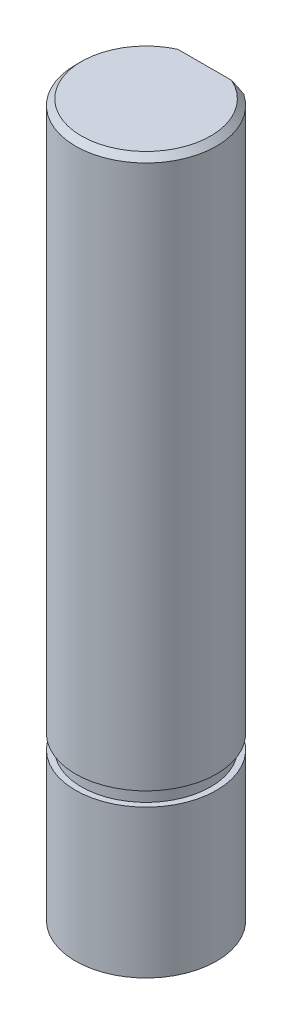
ISO-10303-21;
HEADER;
FILE_DESCRIPTION(('STEP AP214'),'2;1');
FILE_NAME('part.step','',(''),(''),'','','');
FILE_SCHEMA(('AUTOMOTIVE_DESIGN { 1 0 10303 214 1 1 1 1 }'));
ENDSEC;
DATA;
#1=APPLICATION_CONTEXT('core data for automotive mechanical design processes');
#2=APPLICATION_PROTOCOL_DEFINITION('international standard','automotive_design',2000,#1);
#3=PRODUCT_CONTEXT('',#1,'mechanical');
#4=PRODUCT('Part','Part','',(#3));
#5=PRODUCT_RELATED_PRODUCT_CATEGORY('part','',(#4));
#6=PRODUCT_DEFINITION_FORMATION('','',#4);
#7=PRODUCT_DEFINITION_CONTEXT('part definition',#1,'design');
#8=PRODUCT_DEFINITION('design','',#6,#7);
#9=PRODUCT_DEFINITION_SHAPE('','',#8);
#10=(LENGTH_UNIT() NAMED_UNIT(*) SI_UNIT(.MILLI.,.METRE.));
#11=(NAMED_UNIT(*) PLANE_ANGLE_UNIT() SI_UNIT($,.RADIAN.));
#12=(NAMED_UNIT(*) SI_UNIT($,.STERADIAN.) SOLID_ANGLE_UNIT());
#13=UNCERTAINTY_MEASURE_WITH_UNIT(LENGTH_MEASURE(1.E-05),#10,'distance_accuracy_value','');
#14=(GEOMETRIC_REPRESENTATION_CONTEXT(3) GLOBAL_UNCERTAINTY_ASSIGNED_CONTEXT((#13)) GLOBAL_UNIT_ASSIGNED_CONTEXT((#10,
#11,#12)) REPRESENTATION_CONTEXT('',''));
#15=CARTESIAN_POINT('',(0.,0.,0.));
#16=DIRECTION('',(0.,0.,1.));
#17=DIRECTION('',(1.,0.,0.));
#18=AXIS2_PLACEMENT_3D('',#15,#16,#17);
#19=CARTESIAN_POINT('',(0.,16.4,0.));
#20=DIRECTION('',(0.,1.,0.));
#21=DIRECTION('',(-1.,0.,0.));
#22=AXIS2_PLACEMENT_3D('',#19,#20,#21);
#23=CYLINDRICAL_SURFACE('',#22,3.);
#24=DIRECTION('',(0.,1.,0.));
#25=VECTOR('',#24,1.);
#26=CARTESIAN_POINT('',(1.6583123951777,16.4,-2.5));
#27=LINE('',#26,#25);
#28=CARTESIAN_POINT('',(1.6583123951777,20.4,-2.5));
#29=VERTEX_POINT('',#28);
#30=CARTESIAN_POINT('',(1.6583123951777,40.15,-2.5));
#31=VERTEX_POINT('',#30);
#32=EDGE_CURVE('E98',#29,#31,#27,.T.);
#33=ORIENTED_EDGE('',*,*,#32,.T.);
#34=CARTESIAN_POINT('',(0.,40.15,0.));
#35=DIRECTION('',(0.,1.,0.));
#36=DIRECTION('',(-1.,0.,0.));
#37=AXIS2_PLACEMENT_3D('',#34,#35,#36);
#38=CIRCLE('',#37,3.);
#39=CARTESIAN_POINT('',(3.,40.15,0.));
#40=VERTEX_POINT('',#39);
#41=EDGE_CURVE('E27',#40,#31,#38,.T.);
#42=ORIENTED_EDGE('',*,*,#41,.F.);
#43=DIRECTION('',(0.,-1.,0.));
#44=VECTOR('',#43,1.);
#45=CARTESIAN_POINT('',(3.,16.4,0.));
#46=LINE('',#45,#44);
#47=CARTESIAN_POINT('',(3.,17.,0.));
#48=VERTEX_POINT('',#47);
#49=EDGE_CURVE('E11',#40,#48,#46,.T.);
#50=ORIENTED_EDGE('',*,*,#49,.T.);
#51=CARTESIAN_POINT('',(0.,17.,0.));
#52=DIRECTION('',(0.,1.,0.));
#53=DIRECTION('',(-1.,0.,0.));
#54=AXIS2_PLACEMENT_3D('',#51,#52,#53);
#55=CIRCLE('',#54,3.);
#56=EDGE_CURVE('E94',#48,#48,#55,.T.);
#57=ORIENTED_EDGE('',*,*,#56,.T.);
#58=ORIENTED_EDGE('',*,*,#49,.F.);
#59=CARTESIAN_POINT('',(0.,40.15,0.));
#60=DIRECTION('',(0.,1.,0.));
#61=DIRECTION('',(-1.,0.,0.));
#62=AXIS2_PLACEMENT_3D('',#59,#60,#61);
#63=CIRCLE('',#62,3.);
#64=CARTESIAN_POINT('',(-1.6583123951777,40.15,-2.5));
#65=VERTEX_POINT('',#64);
#66=EDGE_CURVE('E148',#65,#40,#63,.T.);
#67=ORIENTED_EDGE('',*,*,#66,.F.);
#68=DIRECTION('',(0.,-1.,0.));
#69=VECTOR('',#68,1.);
#70=CARTESIAN_POINT('',(-1.6583123951777,16.4,-2.5));
#71=LINE('',#70,#69);
#72=CARTESIAN_POINT('',(-1.6583123951777,20.4,-2.5));
#73=VERTEX_POINT('',#72);
#74=EDGE_CURVE('E121',#65,#73,#71,.T.);
#75=ORIENTED_EDGE('',*,*,#74,.T.);
#76=CARTESIAN_POINT('',(0.,20.4,0.));
#77=DIRECTION('',(0.,-1.,0.));
#78=DIRECTION('',(-1.,0.,0.));
#79=AXIS2_PLACEMENT_3D('',#76,#77,#78);
#80=CIRCLE('',#79,3.);
#81=EDGE_CURVE('E140',#73,#29,#80,.T.);
#82=ORIENTED_EDGE('',*,*,#81,.T.);
#83=EDGE_LOOP('',(#33,#42,#50,#57,#58,#67,#75,#82));
#84=FACE_BOUND('',#83,.T.);
#85=ADVANCED_FACE('F16',(#84),#23,.T.);
#86=CARTESIAN_POINT('',(0.,40.275,0.));
#87=DIRECTION('',(0.,-1.,0.));
#88=DIRECTION('',(0.,0.,1.));
#89=AXIS2_PLACEMENT_3D('',#86,#87,#88);
#90=CONICAL_SURFACE('',#89,2.875,0.785398163397442);
#91=CARTESIAN_POINT('',(1.6583123951777,40.15,-2.5));
#92=CARTESIAN_POINT('',(1.39083319268792,40.2978546923137,-2.5));
#93=CARTESIAN_POINT('',(1.14564392373896,40.4,-2.5));
#94=(BOUNDED_CURVE() B_SPLINE_CURVE(2,(#91,#92,#93),.UNSPECIFIED.,.F.,
.F.) B_SPLINE_CURVE_WITH_KNOTS((3,3),(0.,0.057059215015008),
.UNSPECIFIED.) CURVE() GEOMETRIC_REPRESENTATION_ITEM() RATIONAL_B_SPLINE_CURVE((1.,
1.00399858489225,1.)) REPRESENTATION_ITEM(''));
#95=CARTESIAN_POINT('',(1.14564392373896,40.4,-2.5));
#96=VERTEX_POINT('',#95);
#97=EDGE_CURVE('E104',#31,#96,#94,.T.);
#98=ORIENTED_EDGE('',*,*,#97,.T.);
#99=CARTESIAN_POINT('',(0.,40.4,0.));
#100=DIRECTION('',(0.,-1.,0.));
#101=DIRECTION('',(-1.,0.,0.));
#102=AXIS2_PLACEMENT_3D('',#99,#100,#101);
#103=CIRCLE('',#102,2.75);
#104=CARTESIAN_POINT('',(-1.14564392373896,40.4,-2.5));
#105=VERTEX_POINT('',#104);
#106=EDGE_CURVE('E20',#96,#105,#103,.T.);
#107=ORIENTED_EDGE('',*,*,#106,.T.);
#108=CARTESIAN_POINT('',(-1.14564392373896,40.4,-2.5));
#109=CARTESIAN_POINT('',(-1.39083319268792,40.2978546923137,-2.5));
#110=CARTESIAN_POINT('',(-1.6583123951777,40.15,-2.5));
#111=(BOUNDED_CURVE() B_SPLINE_CURVE(2,(#108,#109,#110),.UNSPECIFIED.,.F.,
.F.) B_SPLINE_CURVE_WITH_KNOTS((3,3),(0.,0.057059215015008),
.UNSPECIFIED.) CURVE() GEOMETRIC_REPRESENTATION_ITEM() RATIONAL_B_SPLINE_CURVE((1.,
1.00399858489225,1.)) REPRESENTATION_ITEM(''));
#112=EDGE_CURVE('E122',#105,#65,#111,.T.);
#113=ORIENTED_EDGE('',*,*,#112,.T.);
#114=ORIENTED_EDGE('',*,*,#66,.T.);
#115=ORIENTED_EDGE('',*,*,#41,.T.);
#116=EDGE_LOOP('',(#98,#107,#113,#114,#115));
#117=FACE_BOUND('',#116,.T.);
#118=ADVANCED_FACE('F180',(#117),#90,.T.);
#119=CARTESIAN_POINT('',(0.,40.4,0.));
#120=DIRECTION('',(0.,1.,0.));
#121=DIRECTION('',(1.,0.,0.));
#122=AXIS2_PLACEMENT_3D('',#119,#120,#121);
#123=PLANE('',#122);
#124=DIRECTION('',(-1.,0.,0.));
#125=VECTOR('',#124,1.);
#126=CARTESIAN_POINT('',(0.82915619758885,40.4,-2.5));
#127=LINE('',#126,#125);
#128=EDGE_CURVE('E127',#96,#105,#127,.T.);
#129=ORIENTED_EDGE('',*,*,#128,.T.);
#130=ORIENTED_EDGE('',*,*,#106,.F.);
#131=EDGE_LOOP('',(#129,#130));
#132=FACE_BOUND('',#131,.T.);
#133=ADVANCED_FACE('F185',(#132),#123,.T.);
#134=CARTESIAN_POINT('',(0.,20.4,-2.75));
#135=DIRECTION('',(0.,1.,0.));
#136=DIRECTION('',(1.,0.,0.));
#137=AXIS2_PLACEMENT_3D('',#134,#135,#136);
#138=PLANE('',#137);
#139=ORIENTED_EDGE('',*,*,#81,.F.);
#140=DIRECTION('',(-1.,0.,0.));
#141=VECTOR('',#140,1.);
#142=CARTESIAN_POINT('',(0.82915619758885,20.4,-2.5));
#143=LINE('',#142,#141);
#144=EDGE_CURVE('E118',#29,#73,#143,.T.);
#145=ORIENTED_EDGE('',*,*,#144,.F.);
#146=EDGE_LOOP('',(#139,#145));
#147=FACE_BOUND('',#146,.T.);
#148=ADVANCED_FACE('F190',(#147),#138,.T.);
#149=CARTESIAN_POINT('',(1.6583123951777,40.4,-2.5));
#150=DIRECTION('',(0.,0.,1.));
#151=DIRECTION('',(1.,0.,0.));
#152=AXIS2_PLACEMENT_3D('',#149,#150,#151);
#153=PLANE('',#152);
#154=ORIENTED_EDGE('',*,*,#97,.F.);
#155=ORIENTED_EDGE('',*,*,#32,.F.);
#156=ORIENTED_EDGE('',*,*,#144,.T.);
#157=ORIENTED_EDGE('',*,*,#74,.F.);
#158=ORIENTED_EDGE('',*,*,#112,.F.);
#159=ORIENTED_EDGE('',*,*,#128,.F.);
#160=EDGE_LOOP('',(#154,#155,#156,#157,#158,#159));
#161=FACE_BOUND('',#160,.T.);
#162=ADVANCED_FACE('F188',(#161),#153,.F.);
#163=CARTESIAN_POINT('',(0.,10.1,0.));
#164=DIRECTION('',(0.,1.,0.));
#165=DIRECTION('',(1.,0.,0.));
#166=AXIS2_PLACEMENT_3D('',#163,#164,#165);
#167=PLANE('',#166);
#168=CARTESIAN_POINT('',(0.,10.1,0.));
#169=DIRECTION('',(0.,-1.,0.));
#170=DIRECTION('',(-1.,0.,0.));
#171=AXIS2_PLACEMENT_3D('',#168,#169,#170);
#172=CIRCLE('',#171,3.);
#173=CARTESIAN_POINT('',(3.,10.1,0.));
#174=VERTEX_POINT('',#173);
#175=EDGE_CURVE('E110',#174,#174,#172,.T.);
#176=ORIENTED_EDGE('',*,*,#175,.T.);
#177=EDGE_LOOP('',(#176));
#178=FACE_BOUND('',#177,.T.);
#179=ADVANCED_FACE('F18',(#178),#167,.F.);
#180=CARTESIAN_POINT('',(0.,16.4,0.));
#181=DIRECTION('',(0.,1.,0.));
#182=DIRECTION('',(-1.,0.,0.));
#183=AXIS2_PLACEMENT_3D('',#180,#181,#182);
#184=CYLINDRICAL_SURFACE('',#183,3.);
#185=CARTESIAN_POINT('',(0.,16.4,0.));
#186=DIRECTION('',(0.,-1.,0.));
#187=DIRECTION('',(-1.,0.,0.));
#188=AXIS2_PLACEMENT_3D('',#185,#186,#187);
#189=CIRCLE('',#188,3.);
#190=CARTESIAN_POINT('',(3.,16.4,0.));
#191=VERTEX_POINT('',#190);
#192=EDGE_CURVE('E103',#191,#191,#189,.T.);
#193=ORIENTED_EDGE('',*,*,#192,.T.);
#194=DIRECTION('',(0.,-1.,0.));
#195=VECTOR('',#194,1.);
#196=CARTESIAN_POINT('',(3.,16.4,0.));
#197=LINE('',#196,#195);
#198=EDGE_CURVE('E117',#191,#174,#197,.T.);
#199=ORIENTED_EDGE('',*,*,#198,.T.);
#200=ORIENTED_EDGE('',*,*,#175,.F.);
#201=ORIENTED_EDGE('',*,*,#198,.F.);
#202=EDGE_LOOP('',(#193,#199,#200,#201));
#203=FACE_BOUND('',#202,.T.);
#204=ADVANCED_FACE('F161',(#203),#184,.T.);
#205=CARTESIAN_POINT('',(0.,16.4,0.));
#206=DIRECTION('',(0.,1.,0.));
#207=DIRECTION('',(1.,0.,0.));
#208=AXIS2_PLACEMENT_3D('',#205,#206,#207);
#209=PLANE('',#208);
#210=CARTESIAN_POINT('',(0.,16.4,0.));
#211=DIRECTION('',(0.,1.,0.));
#212=DIRECTION('',(-1.,0.,0.));
#213=AXIS2_PLACEMENT_3D('',#210,#211,#212);
#214=CIRCLE('',#213,2.75);
#215=CARTESIAN_POINT('',(2.75,16.4,0.));
#216=VERTEX_POINT('',#215);
#217=EDGE_CURVE('E84',#216,#216,#214,.T.);
#218=ORIENTED_EDGE('',*,*,#217,.F.);
#219=EDGE_LOOP('',(#218));
#220=FACE_BOUND('',#219,.T.);
#221=ORIENTED_EDGE('',*,*,#192,.F.);
#222=EDGE_LOOP('',(#221));
#223=FACE_BOUND('',#222,.T.);
#224=ADVANCED_FACE('F164',(#220,#223),#209,.T.);
#225=CARTESIAN_POINT('',(0.,17.,0.));
#226=DIRECTION('',(0.,1.,0.));
#227=DIRECTION('',(1.,0.,0.));
#228=AXIS2_PLACEMENT_3D('',#225,#226,#227);
#229=PLANE('',#228);
#230=CARTESIAN_POINT('',(0.,17.,0.));
#231=DIRECTION('',(0.,-1.,0.));
#232=DIRECTION('',(-1.,0.,0.));
#233=AXIS2_PLACEMENT_3D('',#230,#231,#232);
#234=CIRCLE('',#233,2.75);
#235=CARTESIAN_POINT('',(2.75,17.,0.));
#236=VERTEX_POINT('',#235);
#237=EDGE_CURVE('E86',#236,#236,#234,.T.);
#238=ORIENTED_EDGE('',*,*,#237,.F.);
#239=EDGE_LOOP('',(#238));
#240=FACE_BOUND('',#239,.T.);
#241=ORIENTED_EDGE('',*,*,#56,.F.);
#242=EDGE_LOOP('',(#241));
#243=FACE_BOUND('',#242,.T.);
#244=ADVANCED_FACE('F166',(#240,#243),#229,.F.);
#245=CARTESIAN_POINT('',(0.,16.4,0.));
#246=DIRECTION('',(0.,1.,0.));
#247=DIRECTION('',(-1.,0.,0.));
#248=AXIS2_PLACEMENT_3D('',#245,#246,#247);
#249=CYLINDRICAL_SURFACE('',#248,2.75);
#250=ORIENTED_EDGE('',*,*,#217,.T.);
#251=DIRECTION('',(0.,1.,0.));
#252=VECTOR('',#251,1.);
#253=CARTESIAN_POINT('',(2.75,16.4,0.));
#254=LINE('',#253,#252);
#255=EDGE_CURVE('E81',#216,#236,#254,.T.);
#256=ORIENTED_EDGE('',*,*,#255,.T.);
#257=ORIENTED_EDGE('',*,*,#237,.T.);
#258=ORIENTED_EDGE('',*,*,#255,.F.);
#259=EDGE_LOOP('',(#250,#256,#257,#258));
#260=FACE_BOUND('',#259,.T.);
#261=ADVANCED_FACE('F82',(#260),#249,.T.);
#262=CLOSED_SHELL('',(#85,#118,#133,#148,#162,#179,#204,#224,#244,#261));
#263=MANIFOLD_SOLID_BREP('B1',#262);
#264=ADVANCED_BREP_SHAPE_REPRESENTATION('',(#18,#263),#14);
#265=SHAPE_DEFINITION_REPRESENTATION(#9,#264);
ENDSEC;
END-ISO-10303-21;
